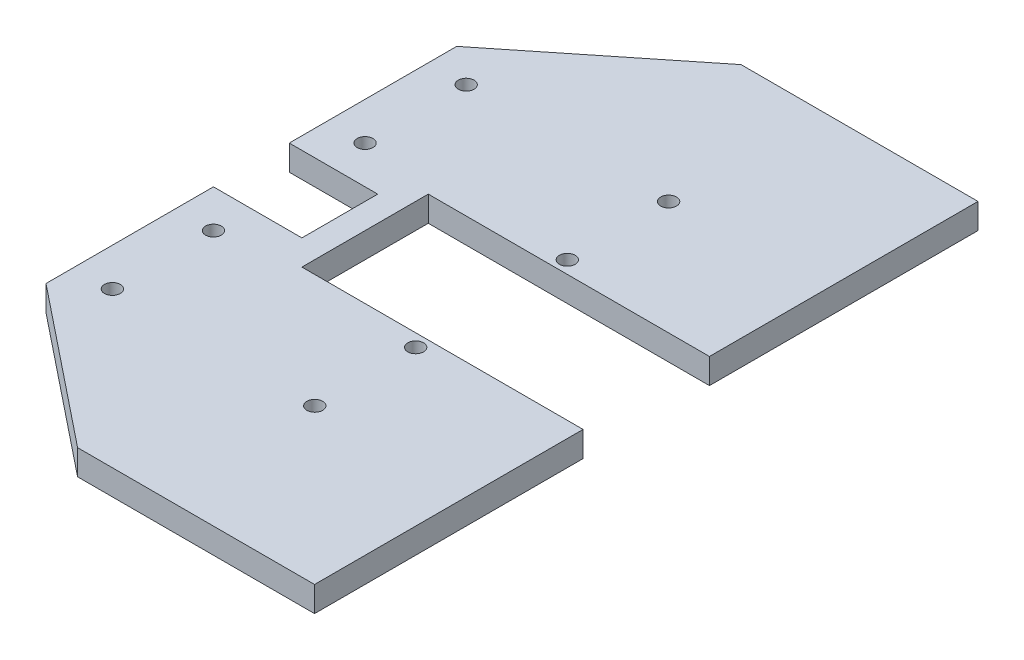
ISO-10303-21;
HEADER;
FILE_DESCRIPTION(('STEP AP214'),'2;1');
FILE_NAME('part.step','',(''),(''),'','','');
FILE_SCHEMA(('AUTOMOTIVE_DESIGN { 1 0 10303 214 1 1 1 1 }'));
ENDSEC;
DATA;
#1=APPLICATION_CONTEXT('core data for automotive mechanical design processes');
#2=APPLICATION_PROTOCOL_DEFINITION('international standard','automotive_design',2000,#1);
#3=PRODUCT_CONTEXT('',#1,'mechanical');
#4=PRODUCT('Part','Part','',(#3));
#5=PRODUCT_RELATED_PRODUCT_CATEGORY('part','',(#4));
#6=PRODUCT_DEFINITION_FORMATION('','',#4);
#7=PRODUCT_DEFINITION_CONTEXT('part definition',#1,'design');
#8=PRODUCT_DEFINITION('design','',#6,#7);
#9=PRODUCT_DEFINITION_SHAPE('','',#8);
#10=(LENGTH_UNIT() NAMED_UNIT(*) SI_UNIT(.MILLI.,.METRE.));
#11=(NAMED_UNIT(*) PLANE_ANGLE_UNIT() SI_UNIT($,.RADIAN.));
#12=(NAMED_UNIT(*) SI_UNIT($,.STERADIAN.) SOLID_ANGLE_UNIT());
#13=UNCERTAINTY_MEASURE_WITH_UNIT(LENGTH_MEASURE(1.E-05),#10,'distance_accuracy_value','');
#14=(GEOMETRIC_REPRESENTATION_CONTEXT(3) GLOBAL_UNCERTAINTY_ASSIGNED_CONTEXT((#13)) GLOBAL_UNIT_ASSIGNED_CONTEXT((#10,
#11,#12)) REPRESENTATION_CONTEXT('',''));
#15=CARTESIAN_POINT('',(0.,0.,0.));
#16=DIRECTION('',(0.,0.,1.));
#17=DIRECTION('',(1.,0.,0.));
#18=AXIS2_PLACEMENT_3D('',#15,#16,#17);
#19=CARTESIAN_POINT('',(17.8793532338309,0.,0.));
#20=DIRECTION('',(-1.,0.,0.));
#21=DIRECTION('',(0.,0.,1.));
#22=AXIS2_PLACEMENT_3D('',#19,#20,#21);
#23=PLANE('',#22);
#24=DIRECTION('',(0.,0.,1.));
#25=VECTOR('',#24,1.);
#26=CARTESIAN_POINT('',(17.8793532338309,8.,0.));
#27=LINE('',#26,#25);
#28=CARTESIAN_POINT('',(17.8793532338309,8.,15.0124378109453));
#29=VERTEX_POINT('',#28);
#30=CARTESIAN_POINT('',(17.8793532338309,8.00000000000001,100.012437810945));
#31=VERTEX_POINT('',#30);
#32=EDGE_CURVE('E234',#29,#31,#27,.T.);
#33=ORIENTED_EDGE('',*,*,#32,.T.);
#34=DIRECTION('',(0.,-1.,0.));
#35=VECTOR('',#34,1.);
#36=CARTESIAN_POINT('',(17.8793532338309,261.179778023443,100.012437810945));
#37=LINE('',#36,#35);
#38=CARTESIAN_POINT('',(17.8793532338309,0.,100.012437810945));
#39=VERTEX_POINT('',#38);
#40=EDGE_CURVE('E44',#31,#39,#37,.T.);
#41=ORIENTED_EDGE('',*,*,#40,.T.);
#42=DIRECTION('',(0.,0.,1.));
#43=VECTOR('',#42,1.);
#44=CARTESIAN_POINT('',(17.8793532338309,0.,0.));
#45=LINE('',#44,#43);
#46=CARTESIAN_POINT('',(17.8793532338309,0.,15.0124378109453));
#47=VERTEX_POINT('',#46);
#48=EDGE_CURVE('E233',#47,#39,#45,.T.);
#49=ORIENTED_EDGE('',*,*,#48,.F.);
#50=DIRECTION('',(0.,-1.,0.));
#51=VECTOR('',#50,1.);
#52=CARTESIAN_POINT('',(17.8793532338309,-103.077640640442,15.0124378109453));
#53=LINE('',#52,#51);
#54=EDGE_CURVE('E39',#29,#47,#53,.T.);
#55=ORIENTED_EDGE('',*,*,#54,.F.);
#56=EDGE_LOOP('',(#33,#41,#49,#55));
#57=FACE_BOUND('',#56,.T.);
#58=ADVANCED_FACE('F36',(#57),#23,.F.);
#59=CARTESIAN_POINT('',(17.8793532338309,0.,-109.987562189055));
#60=VERTEX_POINT('',#59);
#61=CARTESIAN_POINT('',(17.8793532338309,0.,-24.9875621890547));
#62=VERTEX_POINT('',#61);
#63=EDGE_CURVE('E231',#60,#62,#45,.T.);
#64=ORIENTED_EDGE('',*,*,#63,.F.);
#65=DIRECTION('',(0.,1.,0.));
#66=VECTOR('',#65,1.);
#67=CARTESIAN_POINT('',(17.8793532338309,261.179778023443,-109.987562189055));
#68=LINE('',#67,#66);
#69=CARTESIAN_POINT('',(17.8793532338309,8.00000000000001,-109.987562189055));
#70=VERTEX_POINT('',#69);
#71=EDGE_CURVE('E11',#60,#70,#68,.T.);
#72=ORIENTED_EDGE('',*,*,#71,.T.);
#73=CARTESIAN_POINT('',(17.8793532338309,8.,-24.9875621890547));
#74=VERTEX_POINT('',#73);
#75=EDGE_CURVE('E52',#70,#74,#27,.T.);
#76=ORIENTED_EDGE('',*,*,#75,.T.);
#77=DIRECTION('',(0.,1.,0.));
#78=VECTOR('',#77,1.);
#79=CARTESIAN_POINT('',(17.8793532338309,-103.077640640442,-24.9875621890547));
#80=LINE('',#79,#78);
#81=EDGE_CURVE('E237',#62,#74,#80,.T.);
#82=ORIENTED_EDGE('',*,*,#81,.F.);
#83=EDGE_LOOP('',(#64,#72,#76,#82));
#84=FACE_BOUND('',#83,.T.);
#85=ADVANCED_FACE('F340',(#84),#23,.F.);
#86=CARTESIAN_POINT('',(-107.120646766169,8.,-69.9875621890547));
#87=DIRECTION('',(1.,0.,0.));
#88=DIRECTION('',(0.,0.,-1.));
#89=AXIS2_PLACEMENT_3D('',#86,#87,#88);
#90=PLANE('',#89);
#91=DIRECTION('',(0.,0.,1.));
#92=VECTOR('',#91,1.);
#93=CARTESIAN_POINT('',(-107.120646766169,0.,-69.9875621890547));
#94=LINE('',#93,#92);
#95=CARTESIAN_POINT('',(-107.120646766169,0.,-69.9875621890547));
#96=VERTEX_POINT('',#95);
#97=CARTESIAN_POINT('',(-107.120646766169,0.,-16.9875621890547));
#98=VERTEX_POINT('',#97);
#99=EDGE_CURVE('E158',#96,#98,#94,.T.);
#100=ORIENTED_EDGE('',*,*,#99,.T.);
#101=DIRECTION('',(0.,1.,0.));
#102=VECTOR('',#101,1.);
#103=CARTESIAN_POINT('',(-107.120646766169,-36.8781778291715,-16.9875621890547));
#104=LINE('',#103,#102);
#105=CARTESIAN_POINT('',(-107.120646766169,8.,-16.9875621890547));
#106=VERTEX_POINT('',#105);
#107=EDGE_CURVE('E201',#98,#106,#104,.T.);
#108=ORIENTED_EDGE('',*,*,#107,.T.);
#109=DIRECTION('',(0.,0.,1.));
#110=VECTOR('',#109,1.);
#111=CARTESIAN_POINT('',(-107.120646766169,8.,-69.9875621890547));
#112=LINE('',#111,#110);
#113=CARTESIAN_POINT('',(-107.120646766169,8.,-69.9875621890547));
#114=VERTEX_POINT('',#113);
#115=EDGE_CURVE('E221',#114,#106,#112,.T.);
#116=ORIENTED_EDGE('',*,*,#115,.F.);
#117=DIRECTION('',(0.,-1.,0.));
#118=VECTOR('',#117,1.);
#119=CARTESIAN_POINT('',(-107.120646766169,8.,-69.9875621890547));
#120=LINE('',#119,#118);
#121=EDGE_CURVE('E224',#114,#96,#120,.T.);
#122=ORIENTED_EDGE('',*,*,#121,.T.);
#123=EDGE_LOOP('',(#100,#108,#116,#122));
#124=FACE_BOUND('',#123,.T.);
#125=ADVANCED_FACE('F283',(#124),#90,.F.);
#126=CARTESIAN_POINT('',(-107.120646766169,8.,7.01243781094528));
#127=VERTEX_POINT('',#126);
#128=CARTESIAN_POINT('',(-107.120646766169,8.,60.0124378109453));
#129=VERTEX_POINT('',#128);
#130=EDGE_CURVE('E225',#127,#129,#112,.T.);
#131=ORIENTED_EDGE('',*,*,#130,.F.);
#132=DIRECTION('',(0.,1.,0.));
#133=VECTOR('',#132,1.);
#134=CARTESIAN_POINT('',(-107.120646766169,-36.8781778291715,7.01243781094528));
#135=LINE('',#134,#133);
#136=CARTESIAN_POINT('',(-107.120646766169,0.,7.01243781094528));
#137=VERTEX_POINT('',#136);
#138=EDGE_CURVE('E211',#137,#127,#135,.T.);
#139=ORIENTED_EDGE('',*,*,#138,.F.);
#140=CARTESIAN_POINT('',(-107.120646766169,0.,60.0124378109453));
#141=VERTEX_POINT('',#140);
#142=EDGE_CURVE('E220',#137,#141,#94,.T.);
#143=ORIENTED_EDGE('',*,*,#142,.T.);
#144=DIRECTION('',(0.,-1.,0.));
#145=VECTOR('',#144,1.);
#146=CARTESIAN_POINT('',(-107.120646766169,8.,60.0124378109453));
#147=LINE('',#146,#145);
#148=EDGE_CURVE('E228',#129,#141,#147,.T.);
#149=ORIENTED_EDGE('',*,*,#148,.F.);
#150=EDGE_LOOP('',(#131,#139,#143,#149));
#151=FACE_BOUND('',#150,.T.);
#152=ADVANCED_FACE('F269',(#151),#90,.F.);
#153=CARTESIAN_POINT('',(0.,8.,0.));
#154=DIRECTION('',(0.,1.,0.));
#155=DIRECTION('',(0.,0.,1.));
#156=AXIS2_PLACEMENT_3D('',#153,#154,#155);
#157=PLANE('',#156);
#158=ORIENTED_EDGE('',*,*,#75,.F.);
#159=DIRECTION('',(1.,0.,0.));
#160=VECTOR('',#159,1.);
#161=CARTESIAN_POINT('',(-57.1206467661691,8.00000000000001,-109.987562189055));
#162=LINE('',#161,#160);
#163=CARTESIAN_POINT('',(-57.1206467661691,8.00000000000001,-109.987562189055));
#164=VERTEX_POINT('',#163);
#165=EDGE_CURVE('E146',#164,#70,#162,.T.);
#166=ORIENTED_EDGE('',*,*,#165,.F.);
#167=DIRECTION('',(0.78086880944303,0.,-0.624695047554424));
#168=VECTOR('',#167,1.);
#169=CARTESIAN_POINT('',(-107.120646766169,8.00000000000001,-69.9875621890547));
#170=LINE('',#169,#168);
#171=EDGE_CURVE('E145',#114,#164,#170,.T.);
#172=ORIENTED_EDGE('',*,*,#171,.F.);
#173=ORIENTED_EDGE('',*,*,#115,.T.);
#174=DIRECTION('',(-1.,0.,0.));
#175=VECTOR('',#174,1.);
#176=CARTESIAN_POINT('',(-107.120646766169,8.,-16.9875621890547));
#177=LINE('',#176,#175);
#178=CARTESIAN_POINT('',(-79.1206467661691,8.,-16.9875621890547));
#179=VERTEX_POINT('',#178);
#180=EDGE_CURVE('E209',#179,#106,#177,.T.);
#181=ORIENTED_EDGE('',*,*,#180,.F.);
#182=DIRECTION('',(0.,0.,-1.));
#183=VECTOR('',#182,1.);
#184=CARTESIAN_POINT('',(-79.1206467661691,8.,-16.9875621890547));
#185=LINE('',#184,#183);
#186=CARTESIAN_POINT('',(-79.1206467661691,8.,7.01243781094528));
#187=VERTEX_POINT('',#186);
#188=EDGE_CURVE('E206',#187,#179,#185,.T.);
#189=ORIENTED_EDGE('',*,*,#188,.F.);
#190=DIRECTION('',(1.,0.,0.));
#191=VECTOR('',#190,1.);
#192=CARTESIAN_POINT('',(-107.120646766169,8.,7.01243781094528));
#193=LINE('',#192,#191);
#194=EDGE_CURVE('E196',#127,#187,#193,.T.);
#195=ORIENTED_EDGE('',*,*,#194,.F.);
#196=ORIENTED_EDGE('',*,*,#130,.T.);
#197=DIRECTION('',(-0.78086880944303,0.,-0.624695047554424));
#198=VECTOR('',#197,1.);
#199=CARTESIAN_POINT('',(-107.120646766169,8.00000000000001,60.0124378109453));
#200=LINE('',#199,#198);
#201=CARTESIAN_POINT('',(-57.1206467661691,8.00000000000001,100.012437810945));
#202=VERTEX_POINT('',#201);
#203=EDGE_CURVE('E169',#202,#129,#200,.T.);
#204=ORIENTED_EDGE('',*,*,#203,.F.);
#205=DIRECTION('',(-1.,0.,0.));
#206=VECTOR('',#205,1.);
#207=CARTESIAN_POINT('',(-57.1206467661691,8.00000000000001,100.012437810945));
#208=LINE('',#207,#206);
#209=EDGE_CURVE('E167',#31,#202,#208,.T.);
#210=ORIENTED_EDGE('',*,*,#209,.F.);
#211=ORIENTED_EDGE('',*,*,#32,.F.);
#212=DIRECTION('',(1.,0.,0.));
#213=VECTOR('',#212,1.);
#214=CARTESIAN_POINT('',(-71.1206467661691,8.,15.0124378109453));
#215=LINE('',#214,#213);
#216=CARTESIAN_POINT('',(-71.1206467661691,8.,15.0124378109453));
#217=VERTEX_POINT('',#216);
#218=EDGE_CURVE('E185',#217,#29,#215,.T.);
#219=ORIENTED_EDGE('',*,*,#218,.F.);
#220=DIRECTION('',(0.,0.,1.));
#221=VECTOR('',#220,1.);
#222=CARTESIAN_POINT('',(-71.1206467661691,8.,-24.9875621890547));
#223=LINE('',#222,#221);
#224=CARTESIAN_POINT('',(-71.1206467661691,8.,-24.9875621890547));
#225=VERTEX_POINT('',#224);
#226=EDGE_CURVE('E172',#225,#217,#223,.T.);
#227=ORIENTED_EDGE('',*,*,#226,.F.);
#228=DIRECTION('',(-1.,0.,0.));
#229=VECTOR('',#228,1.);
#230=CARTESIAN_POINT('',(-71.1206467661691,8.,-24.9875621890547));
#231=LINE('',#230,#229);
#232=EDGE_CURVE('E188',#74,#225,#231,.T.);
#233=ORIENTED_EDGE('',*,*,#232,.F.);
#234=EDGE_LOOP('',(#158,#166,#172,#173,#181,#189,#195,#196,#204,#210,#211,#219,#227,#233));
#235=FACE_BOUND('',#234,.T.);
#236=CARTESIAN_POINT('',(-31.1206467661691,8.,-28.9875621890547));
#237=DIRECTION('',(0.,-1.,0.));
#238=DIRECTION('',(0.,0.,-1.));
#239=AXIS2_PLACEMENT_3D('',#236,#237,#238);
#240=CIRCLE('',#239,2.5);
#241=CARTESIAN_POINT('',(-31.1206467661691,8.,-31.4875621890547));
#242=VERTEX_POINT('',#241);
#243=EDGE_CURVE('E325',#242,#242,#240,.T.);
#244=ORIENTED_EDGE('',*,*,#243,.T.);
#245=EDGE_LOOP('',(#244));
#246=FACE_BOUND('',#245,.T.);
#247=CARTESIAN_POINT('',(-31.051544466234,8.,-60.9875621890547));
#248=DIRECTION('',(0.,-1.,0.));
#249=DIRECTION('',(0.,0.,-1.));
#250=AXIS2_PLACEMENT_3D('',#247,#248,#249);
#251=CIRCLE('',#250,2.5);
#252=CARTESIAN_POINT('',(-31.051544466234,8.,-63.4875621890547));
#253=VERTEX_POINT('',#252);
#254=EDGE_CURVE('E326',#253,#253,#251,.T.);
#255=ORIENTED_EDGE('',*,*,#254,.T.);
#256=EDGE_LOOP('',(#255));
#257=FACE_BOUND('',#256,.T.);
#258=CARTESIAN_POINT('',(-31.1206467661691,8.,19.0124378109453));
#259=DIRECTION('',(0.,1.,0.));
#260=DIRECTION('',(0.,0.,1.));
#261=AXIS2_PLACEMENT_3D('',#258,#259,#260);
#262=CIRCLE('',#261,2.5);
#263=CARTESIAN_POINT('',(-31.1206467661691,8.,21.5124378109453));
#264=VERTEX_POINT('',#263);
#265=EDGE_CURVE('E313',#264,#264,#262,.T.);
#266=ORIENTED_EDGE('',*,*,#265,.F.);
#267=EDGE_LOOP('',(#266));
#268=FACE_BOUND('',#267,.T.);
#269=CARTESIAN_POINT('',(-31.051544466234,8.,51.0124378109453));
#270=DIRECTION('',(0.,1.,0.));
#271=DIRECTION('',(0.,0.,1.));
#272=AXIS2_PLACEMENT_3D('',#269,#270,#271);
#273=CIRCLE('',#272,2.5);
#274=CARTESIAN_POINT('',(-31.051544466234,8.,53.5124378109453));
#275=VERTEX_POINT('',#274);
#276=EDGE_CURVE('E310',#275,#275,#273,.T.);
#277=ORIENTED_EDGE('',*,*,#276,.F.);
#278=EDGE_LOOP('',(#277));
#279=FACE_BOUND('',#278,.T.);
#280=CARTESIAN_POINT('',(-95.1206467661691,8.,-28.9875621890547));
#281=DIRECTION('',(0.,-1.,0.));
#282=DIRECTION('',(0.,0.,-1.));
#283=AXIS2_PLACEMENT_3D('',#280,#281,#282);
#284=CIRCLE('',#283,2.50000000000001);
#285=CARTESIAN_POINT('',(-95.1206467661691,8.,-31.4875621890547));
#286=VERTEX_POINT('',#285);
#287=EDGE_CURVE('E301',#286,#286,#284,.T.);
#288=ORIENTED_EDGE('',*,*,#287,.T.);
#289=EDGE_LOOP('',(#288));
#290=FACE_BOUND('',#289,.T.);
#291=CARTESIAN_POINT('',(-95.1206467661691,8.,-60.9875621890547));
#292=DIRECTION('',(0.,-1.,0.));
#293=DIRECTION('',(0.,0.,-1.));
#294=AXIS2_PLACEMENT_3D('',#291,#292,#293);
#295=CIRCLE('',#294,2.49999999999995);
#296=CARTESIAN_POINT('',(-95.1206467661691,8.,-63.4875621890547));
#297=VERTEX_POINT('',#296);
#298=EDGE_CURVE('E302',#297,#297,#295,.T.);
#299=ORIENTED_EDGE('',*,*,#298,.T.);
#300=EDGE_LOOP('',(#299));
#301=FACE_BOUND('',#300,.T.);
#302=CARTESIAN_POINT('',(-95.1206467661691,8.,19.0124378109453));
#303=DIRECTION('',(0.,1.,0.));
#304=DIRECTION('',(0.,0.,1.));
#305=AXIS2_PLACEMENT_3D('',#302,#303,#304);
#306=CIRCLE('',#305,2.50000000000001);
#307=CARTESIAN_POINT('',(-95.1206467661691,8.,21.5124378109453));
#308=VERTEX_POINT('',#307);
#309=EDGE_CURVE('E286',#308,#308,#306,.T.);
#310=ORIENTED_EDGE('',*,*,#309,.F.);
#311=EDGE_LOOP('',(#310));
#312=FACE_BOUND('',#311,.T.);
#313=CARTESIAN_POINT('',(-95.1206467661691,8.,51.0124378109453));
#314=DIRECTION('',(0.,1.,0.));
#315=DIRECTION('',(0.,0.,1.));
#316=AXIS2_PLACEMENT_3D('',#313,#314,#315);
#317=CIRCLE('',#316,2.49999999999995);
#318=CARTESIAN_POINT('',(-95.1206467661691,8.,53.5124378109452));
#319=VERTEX_POINT('',#318);
#320=EDGE_CURVE('E289',#319,#319,#317,.T.);
#321=ORIENTED_EDGE('',*,*,#320,.F.);
#322=EDGE_LOOP('',(#321));
#323=FACE_BOUND('',#322,.T.);
#324=ADVANCED_FACE('F260',(#235,#246,#257,#268,#279,#290,#301,#312,#323),#157,.T.);
#325=CARTESIAN_POINT('',(0.,0.,0.));
#326=DIRECTION('',(0.,1.,0.));
#327=DIRECTION('',(0.,0.,1.));
#328=AXIS2_PLACEMENT_3D('',#325,#326,#327);
#329=PLANE('',#328);
#330=CARTESIAN_POINT('',(-31.1206467661691,0.,-28.9875621890547));
#331=DIRECTION('',(0.,1.,0.));
#332=DIRECTION('',(0.,0.,1.));
#333=AXIS2_PLACEMENT_3D('',#330,#331,#332);
#334=CIRCLE('',#333,2.5);
#335=CARTESIAN_POINT('',(-31.1206467661691,0.,-26.4875621890547));
#336=VERTEX_POINT('',#335);
#337=EDGE_CURVE('E317',#336,#336,#334,.T.);
#338=ORIENTED_EDGE('',*,*,#337,.T.);
#339=EDGE_LOOP('',(#338));
#340=FACE_BOUND('',#339,.T.);
#341=CARTESIAN_POINT('',(-31.051544466234,0.,-60.9875621890547));
#342=DIRECTION('',(0.,1.,0.));
#343=DIRECTION('',(0.,0.,1.));
#344=AXIS2_PLACEMENT_3D('',#341,#342,#343);
#345=CIRCLE('',#344,2.5);
#346=CARTESIAN_POINT('',(-31.051544466234,0.,-58.4875621890547));
#347=VERTEX_POINT('',#346);
#348=EDGE_CURVE('E322',#347,#347,#345,.T.);
#349=ORIENTED_EDGE('',*,*,#348,.T.);
#350=EDGE_LOOP('',(#349));
#351=FACE_BOUND('',#350,.T.);
#352=CARTESIAN_POINT('',(-31.1206467661691,0.,19.0124378109453));
#353=DIRECTION('',(0.,1.,0.));
#354=DIRECTION('',(0.,0.,1.));
#355=AXIS2_PLACEMENT_3D('',#352,#353,#354);
#356=CIRCLE('',#355,2.5);
#357=CARTESIAN_POINT('',(-31.1206467661691,0.,21.5124378109453));
#358=VERTEX_POINT('',#357);
#359=EDGE_CURVE('E305',#358,#358,#356,.F.);
#360=ORIENTED_EDGE('',*,*,#359,.F.);
#361=EDGE_LOOP('',(#360));
#362=FACE_BOUND('',#361,.T.);
#363=CARTESIAN_POINT('',(-31.051544466234,0.,51.0124378109453));
#364=DIRECTION('',(0.,1.,0.));
#365=DIRECTION('',(0.,0.,1.));
#366=AXIS2_PLACEMENT_3D('',#363,#364,#365);
#367=CIRCLE('',#366,2.5);
#368=CARTESIAN_POINT('',(-31.051544466234,0.,53.5124378109453));
#369=VERTEX_POINT('',#368);
#370=EDGE_CURVE('E314',#369,#369,#367,.F.);
#371=ORIENTED_EDGE('',*,*,#370,.F.);
#372=EDGE_LOOP('',(#371));
#373=FACE_BOUND('',#372,.T.);
#374=CARTESIAN_POINT('',(-95.1206467661691,0.,-28.9875621890547));
#375=DIRECTION('',(0.,1.,0.));
#376=DIRECTION('',(0.,0.,1.));
#377=AXIS2_PLACEMENT_3D('',#374,#375,#376);
#378=CIRCLE('',#377,2.50000000000001);
#379=CARTESIAN_POINT('',(-95.1206467661691,0.,-26.4875621890547));
#380=VERTEX_POINT('',#379);
#381=EDGE_CURVE('E294',#380,#380,#378,.T.);
#382=ORIENTED_EDGE('',*,*,#381,.T.);
#383=EDGE_LOOP('',(#382));
#384=FACE_BOUND('',#383,.T.);
#385=CARTESIAN_POINT('',(-95.1206467661691,0.,-60.9875621890547));
#386=DIRECTION('',(0.,1.,0.));
#387=DIRECTION('',(0.,0.,1.));
#388=AXIS2_PLACEMENT_3D('',#385,#386,#387);
#389=CIRCLE('',#388,2.49999999999995);
#390=CARTESIAN_POINT('',(-95.1206467661691,0.,-58.4875621890548));
#391=VERTEX_POINT('',#390);
#392=EDGE_CURVE('E298',#391,#391,#389,.T.);
#393=ORIENTED_EDGE('',*,*,#392,.T.);
#394=EDGE_LOOP('',(#393));
#395=FACE_BOUND('',#394,.T.);
#396=CARTESIAN_POINT('',(-95.1206467661691,0.,19.0124378109453));
#397=DIRECTION('',(0.,1.,0.));
#398=DIRECTION('',(0.,0.,1.));
#399=AXIS2_PLACEMENT_3D('',#396,#397,#398);
#400=CIRCLE('',#399,2.50000000000001);
#401=CARTESIAN_POINT('',(-95.1206467661691,0.,21.5124378109453));
#402=VERTEX_POINT('',#401);
#403=EDGE_CURVE('E284',#402,#402,#400,.F.);
#404=ORIENTED_EDGE('',*,*,#403,.F.);
#405=EDGE_LOOP('',(#404));
#406=FACE_BOUND('',#405,.T.);
#407=CARTESIAN_POINT('',(-95.1206467661691,0.,51.0124378109453));
#408=DIRECTION('',(0.,1.,0.));
#409=DIRECTION('',(0.,0.,1.));
#410=AXIS2_PLACEMENT_3D('',#407,#408,#409);
#411=CIRCLE('',#410,2.49999999999995);
#412=CARTESIAN_POINT('',(-95.1206467661691,0.,53.5124378109452));
#413=VERTEX_POINT('',#412);
#414=EDGE_CURVE('E292',#413,#413,#411,.F.);
#415=ORIENTED_EDGE('',*,*,#414,.F.);
#416=EDGE_LOOP('',(#415));
#417=FACE_BOUND('',#416,.T.);
#418=DIRECTION('',(1.,0.,0.));
#419=VECTOR('',#418,1.);
#420=CARTESIAN_POINT('',(-57.1206467661691,0.,-109.987562189055));
#421=LINE('',#420,#419);
#422=CARTESIAN_POINT('',(-57.1206467661691,0.,-109.987562189055));
#423=VERTEX_POINT('',#422);
#424=EDGE_CURVE('E149',#423,#60,#421,.T.);
#425=ORIENTED_EDGE('',*,*,#424,.T.);
#426=ORIENTED_EDGE('',*,*,#63,.T.);
#427=DIRECTION('',(1.,0.,0.));
#428=VECTOR('',#427,1.);
#429=CARTESIAN_POINT('',(-71.1206467661691,0.,-24.9875621890547));
#430=LINE('',#429,#428);
#431=CARTESIAN_POINT('',(-71.1206467661691,0.,-24.9875621890547));
#432=VERTEX_POINT('',#431);
#433=EDGE_CURVE('E177',#432,#62,#430,.T.);
#434=ORIENTED_EDGE('',*,*,#433,.F.);
#435=DIRECTION('',(0.,0.,-1.));
#436=VECTOR('',#435,1.);
#437=CARTESIAN_POINT('',(-71.1206467661691,0.,-24.9875621890547));
#438=LINE('',#437,#436);
#439=CARTESIAN_POINT('',(-71.1206467661691,0.,15.0124378109453));
#440=VERTEX_POINT('',#439);
#441=EDGE_CURVE('E180',#440,#432,#438,.T.);
#442=ORIENTED_EDGE('',*,*,#441,.F.);
#443=DIRECTION('',(-1.,0.,0.));
#444=VECTOR('',#443,1.);
#445=CARTESIAN_POINT('',(-71.1206467661691,0.,15.0124378109453));
#446=LINE('',#445,#444);
#447=EDGE_CURVE('E183',#47,#440,#446,.T.);
#448=ORIENTED_EDGE('',*,*,#447,.F.);
#449=ORIENTED_EDGE('',*,*,#48,.T.);
#450=DIRECTION('',(-1.,0.,0.));
#451=VECTOR('',#450,1.);
#452=CARTESIAN_POINT('',(-57.1206467661691,0.,100.012437810945));
#453=LINE('',#452,#451);
#454=CARTESIAN_POINT('',(-57.1206467661691,0.,100.012437810945));
#455=VERTEX_POINT('',#454);
#456=EDGE_CURVE('E159',#39,#455,#453,.T.);
#457=ORIENTED_EDGE('',*,*,#456,.T.);
#458=DIRECTION('',(-0.78086880944303,0.,-0.624695047554424));
#459=VECTOR('',#458,1.);
#460=CARTESIAN_POINT('',(-107.120646766169,0.,60.0124378109453));
#461=LINE('',#460,#459);
#462=EDGE_CURVE('E161',#455,#141,#461,.T.);
#463=ORIENTED_EDGE('',*,*,#462,.T.);
#464=ORIENTED_EDGE('',*,*,#142,.F.);
#465=DIRECTION('',(-1.,0.,0.));
#466=VECTOR('',#465,1.);
#467=CARTESIAN_POINT('',(-107.120646766169,0.,7.01243781094528));
#468=LINE('',#467,#466);
#469=CARTESIAN_POINT('',(-79.1206467661691,0.,7.01243781094528));
#470=VERTEX_POINT('',#469);
#471=EDGE_CURVE('E203',#470,#137,#468,.T.);
#472=ORIENTED_EDGE('',*,*,#471,.F.);
#473=DIRECTION('',(0.,0.,1.));
#474=VECTOR('',#473,1.);
#475=CARTESIAN_POINT('',(-79.1206467661691,0.,-16.9875621890547));
#476=LINE('',#475,#474);
#477=CARTESIAN_POINT('',(-79.1206467661691,0.,-16.9875621890547));
#478=VERTEX_POINT('',#477);
#479=EDGE_CURVE('E197',#478,#470,#476,.T.);
#480=ORIENTED_EDGE('',*,*,#479,.F.);
#481=DIRECTION('',(1.,0.,0.));
#482=VECTOR('',#481,1.);
#483=CARTESIAN_POINT('',(-107.120646766169,0.,-16.9875621890547));
#484=LINE('',#483,#482);
#485=EDGE_CURVE('E200',#98,#478,#484,.T.);
#486=ORIENTED_EDGE('',*,*,#485,.F.);
#487=ORIENTED_EDGE('',*,*,#99,.F.);
#488=DIRECTION('',(0.78086880944303,0.,-0.624695047554424));
#489=VECTOR('',#488,1.);
#490=CARTESIAN_POINT('',(-107.120646766169,0.,-69.9875621890547));
#491=LINE('',#490,#489);
#492=EDGE_CURVE('E143',#96,#423,#491,.T.);
#493=ORIENTED_EDGE('',*,*,#492,.T.);
#494=EDGE_LOOP('',(#425,#426,#434,#442,#448,#449,#457,#463,#464,#472,#480,#486,#487,#493));
#495=FACE_BOUND('',#494,.T.);
#496=ADVANCED_FACE('F155',(#340,#351,#362,#373,#384,#395,#406,#417,#495),#329,.F.);
#497=CARTESIAN_POINT('',(-107.120646766169,-36.8781778291715,-16.9875621890547));
#498=DIRECTION('',(0.,0.,-1.));
#499=DIRECTION('',(-1.,0.,0.));
#500=AXIS2_PLACEMENT_3D('',#497,#498,#499);
#501=PLANE('',#500);
#502=ORIENTED_EDGE('',*,*,#485,.T.);
#503=DIRECTION('',(0.,1.,0.));
#504=VECTOR('',#503,1.);
#505=CARTESIAN_POINT('',(-79.1206467661691,-36.8781778291715,-16.9875621890547));
#506=LINE('',#505,#504);
#507=EDGE_CURVE('E214',#478,#179,#506,.T.);
#508=ORIENTED_EDGE('',*,*,#507,.T.);
#509=ORIENTED_EDGE('',*,*,#180,.T.);
#510=ORIENTED_EDGE('',*,*,#107,.F.);
#511=EDGE_LOOP('',(#502,#508,#509,#510));
#512=FACE_BOUND('',#511,.T.);
#513=ADVANCED_FACE('F281',(#512),#501,.F.);
#514=CARTESIAN_POINT('',(-79.1206467661691,-36.8781778291715,-16.9875621890547));
#515=DIRECTION('',(1.,0.,0.));
#516=DIRECTION('',(0.,0.,-1.));
#517=AXIS2_PLACEMENT_3D('',#514,#515,#516);
#518=PLANE('',#517);
#519=ORIENTED_EDGE('',*,*,#479,.T.);
#520=DIRECTION('',(0.,1.,0.));
#521=VECTOR('',#520,1.);
#522=CARTESIAN_POINT('',(-79.1206467661691,-36.8781778291715,7.01243781094528));
#523=LINE('',#522,#521);
#524=EDGE_CURVE('E216',#470,#187,#523,.T.);
#525=ORIENTED_EDGE('',*,*,#524,.T.);
#526=ORIENTED_EDGE('',*,*,#188,.T.);
#527=ORIENTED_EDGE('',*,*,#507,.F.);
#528=EDGE_LOOP('',(#519,#525,#526,#527));
#529=FACE_BOUND('',#528,.T.);
#530=ADVANCED_FACE('F278',(#529),#518,.F.);
#531=CARTESIAN_POINT('',(-107.120646766169,-36.8781778291715,7.01243781094528));
#532=DIRECTION('',(0.,0.,1.));
#533=DIRECTION('',(1.,0.,0.));
#534=AXIS2_PLACEMENT_3D('',#531,#532,#533);
#535=PLANE('',#534);
#536=ORIENTED_EDGE('',*,*,#471,.T.);
#537=ORIENTED_EDGE('',*,*,#138,.T.);
#538=ORIENTED_EDGE('',*,*,#194,.T.);
#539=ORIENTED_EDGE('',*,*,#524,.F.);
#540=EDGE_LOOP('',(#536,#537,#538,#539));
#541=FACE_BOUND('',#540,.T.);
#542=ADVANCED_FACE('F274',(#541),#535,.F.);
#543=CARTESIAN_POINT('',(-71.1206467661691,-103.077640640442,-24.9875621890547));
#544=DIRECTION('',(-1.,0.,0.));
#545=DIRECTION('',(0.,0.,1.));
#546=AXIS2_PLACEMENT_3D('',#543,#544,#545);
#547=PLANE('',#546);
#548=ORIENTED_EDGE('',*,*,#441,.T.);
#549=DIRECTION('',(0.,1.,0.));
#550=VECTOR('',#549,1.);
#551=CARTESIAN_POINT('',(-71.1206467661691,-103.077640640442,-24.9875621890547));
#552=LINE('',#551,#550);
#553=EDGE_CURVE('E181',#432,#225,#552,.T.);
#554=ORIENTED_EDGE('',*,*,#553,.T.);
#555=ORIENTED_EDGE('',*,*,#226,.T.);
#556=DIRECTION('',(0.,1.,0.));
#557=VECTOR('',#556,1.);
#558=CARTESIAN_POINT('',(-71.1206467661691,-103.077640640442,15.0124378109453));
#559=LINE('',#558,#557);
#560=EDGE_CURVE('E190',#440,#217,#559,.T.);
#561=ORIENTED_EDGE('',*,*,#560,.F.);
#562=EDGE_LOOP('',(#548,#554,#555,#561));
#563=FACE_BOUND('',#562,.T.);
#564=ADVANCED_FACE('F257',(#563),#547,.F.);
#565=CARTESIAN_POINT('',(-71.1206467661691,-103.077640640442,-24.9875621890547));
#566=DIRECTION('',(0.,0.,-1.));
#567=DIRECTION('',(-1.,0.,0.));
#568=AXIS2_PLACEMENT_3D('',#565,#566,#567);
#569=PLANE('',#568);
#570=ORIENTED_EDGE('',*,*,#433,.T.);
#571=ORIENTED_EDGE('',*,*,#81,.T.);
#572=ORIENTED_EDGE('',*,*,#232,.T.);
#573=ORIENTED_EDGE('',*,*,#553,.F.);
#574=EDGE_LOOP('',(#570,#571,#572,#573));
#575=FACE_BOUND('',#574,.T.);
#576=ADVANCED_FACE('F387',(#575),#569,.F.);
#577=CARTESIAN_POINT('',(-71.1206467661691,-103.077640640442,15.0124378109453));
#578=DIRECTION('',(0.,0.,1.));
#579=DIRECTION('',(1.,0.,0.));
#580=AXIS2_PLACEMENT_3D('',#577,#578,#579);
#581=PLANE('',#580);
#582=ORIENTED_EDGE('',*,*,#218,.T.);
#583=ORIENTED_EDGE('',*,*,#54,.T.);
#584=ORIENTED_EDGE('',*,*,#447,.T.);
#585=ORIENTED_EDGE('',*,*,#560,.T.);
#586=EDGE_LOOP('',(#582,#583,#584,#585));
#587=FACE_BOUND('',#586,.T.);
#588=ADVANCED_FACE('F254',(#587),#581,.F.);
#589=CARTESIAN_POINT('',(-57.1206467661691,261.179778023443,100.012437810945));
#590=DIRECTION('',(0.,0.,1.));
#591=DIRECTION('',(1.,0.,0.));
#592=AXIS2_PLACEMENT_3D('',#589,#590,#591);
#593=PLANE('',#592);
#594=ORIENTED_EDGE('',*,*,#40,.F.);
#595=ORIENTED_EDGE('',*,*,#209,.T.);
#596=DIRECTION('',(0.,-1.,0.));
#597=VECTOR('',#596,1.);
#598=CARTESIAN_POINT('',(-57.1206467661691,261.179778023443,100.012437810945));
#599=LINE('',#598,#597);
#600=EDGE_CURVE('E173',#202,#455,#599,.T.);
#601=ORIENTED_EDGE('',*,*,#600,.T.);
#602=ORIENTED_EDGE('',*,*,#456,.F.);
#603=EDGE_LOOP('',(#594,#595,#601,#602));
#604=FACE_BOUND('',#603,.T.);
#605=ADVANCED_FACE('F246',(#604),#593,.T.);
#606=CARTESIAN_POINT('',(-107.120646766169,261.179778023443,60.0124378109453));
#607=DIRECTION('',(-0.624695047554424,0.,0.78086880944303));
#608=DIRECTION('',(0.78086880944303,0.,0.624695047554424));
#609=AXIS2_PLACEMENT_3D('',#606,#607,#608);
#610=PLANE('',#609);
#611=ORIENTED_EDGE('',*,*,#600,.F.);
#612=ORIENTED_EDGE('',*,*,#203,.T.);
#613=ORIENTED_EDGE('',*,*,#148,.T.);
#614=ORIENTED_EDGE('',*,*,#462,.F.);
#615=EDGE_LOOP('',(#611,#612,#613,#614));
#616=FACE_BOUND('',#615,.T.);
#617=ADVANCED_FACE('F267',(#616),#610,.T.);
#618=CARTESIAN_POINT('',(-107.120646766169,261.179778023443,-69.9875621890547));
#619=DIRECTION('',(-0.624695047554424,0.,-0.78086880944303));
#620=DIRECTION('',(-0.78086880944303,0.,0.624695047554424));
#621=AXIS2_PLACEMENT_3D('',#618,#619,#620);
#622=PLANE('',#621);
#623=ORIENTED_EDGE('',*,*,#121,.F.);
#624=ORIENTED_EDGE('',*,*,#171,.T.);
#625=DIRECTION('',(0.,-1.,0.));
#626=VECTOR('',#625,1.);
#627=CARTESIAN_POINT('',(-57.1206467661691,261.179778023443,-109.987562189055));
#628=LINE('',#627,#626);
#629=EDGE_CURVE('E139',#164,#423,#628,.T.);
#630=ORIENTED_EDGE('',*,*,#629,.T.);
#631=ORIENTED_EDGE('',*,*,#492,.F.);
#632=EDGE_LOOP('',(#623,#624,#630,#631));
#633=FACE_BOUND('',#632,.T.);
#634=ADVANCED_FACE('F141',(#633),#622,.T.);
#635=CARTESIAN_POINT('',(-57.1206467661691,261.179778023443,-109.987562189055));
#636=DIRECTION('',(0.,0.,-1.));
#637=DIRECTION('',(-1.,0.,0.));
#638=AXIS2_PLACEMENT_3D('',#635,#636,#637);
#639=PLANE('',#638);
#640=ORIENTED_EDGE('',*,*,#71,.F.);
#641=ORIENTED_EDGE('',*,*,#424,.F.);
#642=ORIENTED_EDGE('',*,*,#629,.F.);
#643=ORIENTED_EDGE('',*,*,#165,.T.);
#644=EDGE_LOOP('',(#640,#641,#642,#643));
#645=FACE_BOUND('',#644,.T.);
#646=ADVANCED_FACE('F150',(#645),#639,.T.);
#647=CARTESIAN_POINT('',(-95.1206467661691,-7.07106781186551,51.0124378109453));
#648=DIRECTION('',(0.,1.,0.));
#649=DIRECTION('',(0.,0.,1.));
#650=AXIS2_PLACEMENT_3D('',#647,#648,#649);
#651=CYLINDRICAL_SURFACE('',#650,2.49999999999995);
#652=ORIENTED_EDGE('',*,*,#414,.T.);
#653=EDGE_LOOP('',(#652));
#654=FACE_BOUND('',#653,.T.);
#655=ORIENTED_EDGE('',*,*,#320,.T.);
#656=EDGE_LOOP('',(#655));
#657=FACE_BOUND('',#656,.T.);
#658=ADVANCED_FACE('F414',(#654,#657),#651,.F.);
#659=CARTESIAN_POINT('',(-95.1206467661691,-7.07106781186551,19.0124378109453));
#660=DIRECTION('',(0.,1.,0.));
#661=DIRECTION('',(0.,0.,1.));
#662=AXIS2_PLACEMENT_3D('',#659,#660,#661);
#663=CYLINDRICAL_SURFACE('',#662,2.50000000000001);
#664=ORIENTED_EDGE('',*,*,#403,.T.);
#665=EDGE_LOOP('',(#664));
#666=FACE_BOUND('',#665,.T.);
#667=ORIENTED_EDGE('',*,*,#309,.T.);
#668=EDGE_LOOP('',(#667));
#669=FACE_BOUND('',#668,.T.);
#670=ADVANCED_FACE('F431',(#666,#669),#663,.F.);
#671=CARTESIAN_POINT('',(-95.1206467661691,-7.07106781186551,-60.9875621890547));
#672=DIRECTION('',(0.,1.,0.));
#673=DIRECTION('',(0.,0.,1.));
#674=AXIS2_PLACEMENT_3D('',#671,#672,#673);
#675=CYLINDRICAL_SURFACE('',#674,2.49999999999995);
#676=ORIENTED_EDGE('',*,*,#392,.F.);
#677=EDGE_LOOP('',(#676));
#678=FACE_BOUND('',#677,.T.);
#679=ORIENTED_EDGE('',*,*,#298,.F.);
#680=EDGE_LOOP('',(#679));
#681=FACE_BOUND('',#680,.T.);
#682=ADVANCED_FACE('F440',(#678,#681),#675,.F.);
#683=CARTESIAN_POINT('',(-95.1206467661691,-7.07106781186551,-28.9875621890547));
#684=DIRECTION('',(0.,1.,0.));
#685=DIRECTION('',(0.,0.,1.));
#686=AXIS2_PLACEMENT_3D('',#683,#684,#685);
#687=CYLINDRICAL_SURFACE('',#686,2.50000000000001);
#688=ORIENTED_EDGE('',*,*,#381,.F.);
#689=EDGE_LOOP('',(#688));
#690=FACE_BOUND('',#689,.T.);
#691=ORIENTED_EDGE('',*,*,#287,.F.);
#692=EDGE_LOOP('',(#691));
#693=FACE_BOUND('',#692,.T.);
#694=ADVANCED_FACE('F449',(#690,#693),#687,.F.);
#695=CARTESIAN_POINT('',(-31.051544466234,-7.07106781186548,51.0124378109453));
#696=DIRECTION('',(0.,1.,0.));
#697=DIRECTION('',(0.,0.,1.));
#698=AXIS2_PLACEMENT_3D('',#695,#696,#697);
#699=CYLINDRICAL_SURFACE('',#698,2.5);
#700=ORIENTED_EDGE('',*,*,#370,.T.);
#701=EDGE_LOOP('',(#700));
#702=FACE_BOUND('',#701,.T.);
#703=ORIENTED_EDGE('',*,*,#276,.T.);
#704=EDGE_LOOP('',(#703));
#705=FACE_BOUND('',#704,.T.);
#706=ADVANCED_FACE('F458',(#702,#705),#699,.F.);
#707=CARTESIAN_POINT('',(-31.1206467661691,-7.07106781186548,19.0124378109453));
#708=DIRECTION('',(0.,1.,0.));
#709=DIRECTION('',(0.,0.,1.));
#710=AXIS2_PLACEMENT_3D('',#707,#708,#709);
#711=CYLINDRICAL_SURFACE('',#710,2.5);
#712=ORIENTED_EDGE('',*,*,#359,.T.);
#713=EDGE_LOOP('',(#712));
#714=FACE_BOUND('',#713,.T.);
#715=ORIENTED_EDGE('',*,*,#265,.T.);
#716=EDGE_LOOP('',(#715));
#717=FACE_BOUND('',#716,.T.);
#718=ADVANCED_FACE('F345',(#714,#717),#711,.F.);
#719=CARTESIAN_POINT('',(-31.051544466234,-7.07106781186548,-60.9875621890547));
#720=DIRECTION('',(0.,1.,0.));
#721=DIRECTION('',(0.,0.,1.));
#722=AXIS2_PLACEMENT_3D('',#719,#720,#721);
#723=CYLINDRICAL_SURFACE('',#722,2.5);
#724=ORIENTED_EDGE('',*,*,#348,.F.);
#725=EDGE_LOOP('',(#724));
#726=FACE_BOUND('',#725,.T.);
#727=ORIENTED_EDGE('',*,*,#254,.F.);
#728=EDGE_LOOP('',(#727));
#729=FACE_BOUND('',#728,.T.);
#730=ADVANCED_FACE('F337',(#726,#729),#723,.F.);
#731=CARTESIAN_POINT('',(-31.1206467661691,-7.07106781186548,-28.9875621890547));
#732=DIRECTION('',(0.,1.,0.));
#733=DIRECTION('',(0.,0.,1.));
#734=AXIS2_PLACEMENT_3D('',#731,#732,#733);
#735=CYLINDRICAL_SURFACE('',#734,2.5);
#736=ORIENTED_EDGE('',*,*,#337,.F.);
#737=EDGE_LOOP('',(#736));
#738=FACE_BOUND('',#737,.T.);
#739=ORIENTED_EDGE('',*,*,#243,.F.);
#740=EDGE_LOOP('',(#739));
#741=FACE_BOUND('',#740,.T.);
#742=ADVANCED_FACE('F335',(#738,#741),#735,.F.);
#743=CLOSED_SHELL('',(#58,#85,#125,#152,#324,#496,#513,#530,#542,#564,#576,#588,#605,#617,#634,
#646,#658,#670,#682,#694,#706,#718,#730,#742));
#744=MANIFOLD_SOLID_BREP('B2',#743);
#745=ADVANCED_BREP_SHAPE_REPRESENTATION('',(#18,#744),#14);
#746=SHAPE_DEFINITION_REPRESENTATION(#9,#745);
ENDSEC;
END-ISO-10303-21;
